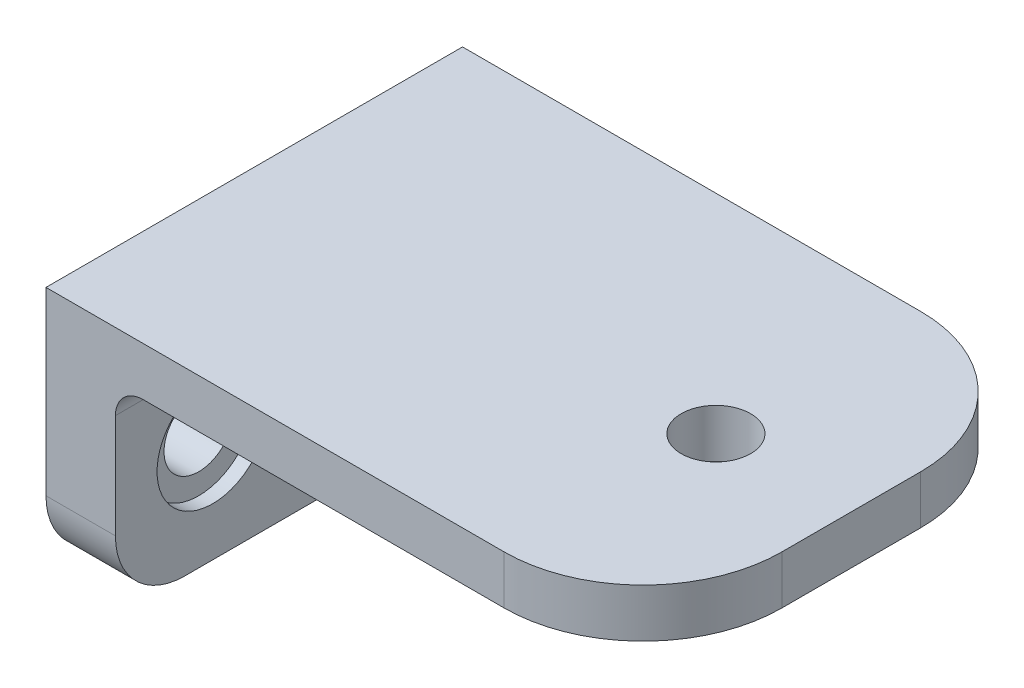
ISO-10303-21;
HEADER;
FILE_DESCRIPTION(('STEP AP214'),'2;1');
FILE_NAME('part.step','',(''),(''),'','','');
FILE_SCHEMA(('AUTOMOTIVE_DESIGN { 1 0 10303 214 1 1 1 1 }'));
ENDSEC;
DATA;
#1=APPLICATION_CONTEXT('core data for automotive mechanical design processes');
#2=APPLICATION_PROTOCOL_DEFINITION('international standard','automotive_design',2000,#1);
#3=PRODUCT_CONTEXT('',#1,'mechanical');
#4=PRODUCT('Part','Part','',(#3));
#5=PRODUCT_RELATED_PRODUCT_CATEGORY('part','',(#4));
#6=PRODUCT_DEFINITION_FORMATION('','',#4);
#7=PRODUCT_DEFINITION_CONTEXT('part definition',#1,'design');
#8=PRODUCT_DEFINITION('design','',#6,#7);
#9=PRODUCT_DEFINITION_SHAPE('','',#8);
#10=(LENGTH_UNIT() NAMED_UNIT(*) SI_UNIT(.MILLI.,.METRE.));
#11=(NAMED_UNIT(*) PLANE_ANGLE_UNIT() SI_UNIT($,.RADIAN.));
#12=(NAMED_UNIT(*) SI_UNIT($,.STERADIAN.) SOLID_ANGLE_UNIT());
#13=UNCERTAINTY_MEASURE_WITH_UNIT(LENGTH_MEASURE(1.E-05),#10,'distance_accuracy_value','');
#14=(GEOMETRIC_REPRESENTATION_CONTEXT(3) GLOBAL_UNCERTAINTY_ASSIGNED_CONTEXT((#13)) GLOBAL_UNIT_ASSIGNED_CONTEXT((#10,
#11,#12)) REPRESENTATION_CONTEXT('',''));
#15=CARTESIAN_POINT('',(0.,0.,0.));
#16=DIRECTION('',(0.,0.,1.));
#17=DIRECTION('',(1.,0.,0.));
#18=AXIS2_PLACEMENT_3D('',#15,#16,#17);
#19=CARTESIAN_POINT('',(19.,3.5,15.));
#20=DIRECTION('',(0.,0.,-1.));
#21=DIRECTION('',(-1.,0.,0.));
#22=AXIS2_PLACEMENT_3D('',#19,#20,#21);
#23=PLANE('',#22);
#24=DIRECTION('',(0.,1.,0.));
#25=VECTOR('',#24,1.);
#26=CARTESIAN_POINT('',(-24.,3.5,15.));
#27=LINE('',#26,#25);
#28=CARTESIAN_POINT('',(-24.,-9.5,15.));
#29=VERTEX_POINT('',#28);
#30=CARTESIAN_POINT('',(-24.,3.5,15.));
#31=VERTEX_POINT('',#30);
#32=EDGE_CURVE('E117',#29,#31,#27,.T.);
#33=ORIENTED_EDGE('',*,*,#32,.F.);
#34=DIRECTION('',(1.,0.,0.));
#35=VECTOR('',#34,1.);
#36=CARTESIAN_POINT('',(19.,-9.5,15.));
#37=LINE('',#36,#35);
#38=CARTESIAN_POINT('',(-19.,-9.5,15.));
#39=VERTEX_POINT('',#38);
#40=EDGE_CURVE('E11',#29,#39,#37,.T.);
#41=ORIENTED_EDGE('',*,*,#40,.T.);
#42=DIRECTION('',(0.,1.,0.));
#43=VECTOR('',#42,1.);
#44=CARTESIAN_POINT('',(-19.,3.5,15.));
#45=LINE('',#44,#43);
#46=CARTESIAN_POINT('',(-19.,-2.,15.));
#47=VERTEX_POINT('',#46);
#48=EDGE_CURVE('E151',#39,#47,#45,.T.);
#49=ORIENTED_EDGE('',*,*,#48,.T.);
#50=CARTESIAN_POINT('',(-17.,-2.,15.));
#51=DIRECTION('',(0.,0.,-1.));
#52=DIRECTION('',(-1.,0.,0.));
#53=AXIS2_PLACEMENT_3D('',#50,#51,#52);
#54=CIRCLE('',#53,2.);
#55=CARTESIAN_POINT('',(-17.,0.,15.));
#56=VERTEX_POINT('',#55);
#57=EDGE_CURVE('E196',#47,#56,#54,.T.);
#58=ORIENTED_EDGE('',*,*,#57,.T.);
#59=DIRECTION('',(1.,0.,0.));
#60=VECTOR('',#59,1.);
#61=CARTESIAN_POINT('',(19.,0.,15.));
#62=LINE('',#61,#60);
#63=CARTESIAN_POINT('',(9.,0.,15.));
#64=VERTEX_POINT('',#63);
#65=EDGE_CURVE('E139',#56,#64,#62,.T.);
#66=ORIENTED_EDGE('',*,*,#65,.T.);
#67=DIRECTION('',(0.,-1.,0.));
#68=VECTOR('',#67,1.);
#69=CARTESIAN_POINT('',(9.,3.5,15.));
#70=LINE('',#69,#68);
#71=CARTESIAN_POINT('',(9.,3.5,15.));
#72=VERTEX_POINT('',#71);
#73=EDGE_CURVE('E129',#64,#72,#70,.F.);
#74=ORIENTED_EDGE('',*,*,#73,.T.);
#75=DIRECTION('',(1.,0.,0.));
#76=VECTOR('',#75,1.);
#77=CARTESIAN_POINT('',(19.,3.5,15.));
#78=LINE('',#77,#76);
#79=EDGE_CURVE('E127',#31,#72,#78,.T.);
#80=ORIENTED_EDGE('',*,*,#79,.F.);
#81=EDGE_LOOP('',(#33,#41,#49,#58,#66,#74,#80));
#82=FACE_BOUND('',#81,.T.);
#83=ADVANCED_FACE('F33',(#82),#23,.F.);
#84=CARTESIAN_POINT('',(19.,3.5,15.));
#85=DIRECTION('',(-1.,0.,0.));
#86=DIRECTION('',(0.,0.,1.));
#87=AXIS2_PLACEMENT_3D('',#84,#85,#86);
#88=PLANE('',#87);
#89=DIRECTION('',(0.,0.,-1.));
#90=VECTOR('',#89,1.);
#91=CARTESIAN_POINT('',(19.,0.,15.));
#92=LINE('',#91,#90);
#93=CARTESIAN_POINT('',(19.,0.,5.));
#94=VERTEX_POINT('',#93);
#95=CARTESIAN_POINT('',(19.,0.,-5.));
#96=VERTEX_POINT('',#95);
#97=EDGE_CURVE('E141',#94,#96,#92,.T.);
#98=ORIENTED_EDGE('',*,*,#97,.T.);
#99=DIRECTION('',(0.,-1.,0.));
#100=VECTOR('',#99,1.);
#101=CARTESIAN_POINT('',(19.,3.5,-5.));
#102=LINE('',#101,#100);
#103=CARTESIAN_POINT('',(19.,3.5,-5.));
#104=VERTEX_POINT('',#103);
#105=EDGE_CURVE('E184',#96,#104,#102,.F.);
#106=ORIENTED_EDGE('',*,*,#105,.T.);
#107=DIRECTION('',(0.,0.,-1.));
#108=VECTOR('',#107,1.);
#109=CARTESIAN_POINT('',(19.,3.5,15.));
#110=LINE('',#109,#108);
#111=CARTESIAN_POINT('',(19.,3.5,5.));
#112=VERTEX_POINT('',#111);
#113=EDGE_CURVE('E132',#112,#104,#110,.T.);
#114=ORIENTED_EDGE('',*,*,#113,.F.);
#115=DIRECTION('',(0.,-1.,0.));
#116=VECTOR('',#115,1.);
#117=CARTESIAN_POINT('',(19.,3.5,5.));
#118=LINE('',#117,#116);
#119=EDGE_CURVE('E181',#112,#94,#118,.T.);
#120=ORIENTED_EDGE('',*,*,#119,.T.);
#121=EDGE_LOOP('',(#98,#106,#114,#120));
#122=FACE_BOUND('',#121,.T.);
#123=ADVANCED_FACE('F238',(#122),#88,.F.);
#124=CARTESIAN_POINT('',(19.,3.5,-15.));
#125=DIRECTION('',(0.,0.,1.));
#126=DIRECTION('',(1.,0.,0.));
#127=AXIS2_PLACEMENT_3D('',#124,#125,#126);
#128=PLANE('',#127);
#129=DIRECTION('',(0.,-1.,0.));
#130=VECTOR('',#129,1.);
#131=CARTESIAN_POINT('',(-19.,3.5,-15.));
#132=LINE('',#131,#130);
#133=CARTESIAN_POINT('',(-19.,-2.,-15.));
#134=VERTEX_POINT('',#133);
#135=CARTESIAN_POINT('',(-19.,-9.5,-15.));
#136=VERTEX_POINT('',#135);
#137=EDGE_CURVE('E145',#134,#136,#132,.T.);
#138=ORIENTED_EDGE('',*,*,#137,.T.);
#139=DIRECTION('',(1.,0.,0.));
#140=VECTOR('',#139,1.);
#141=CARTESIAN_POINT('',(19.,-9.5,-15.));
#142=LINE('',#141,#140);
#143=CARTESIAN_POINT('',(-24.,-9.5,-15.));
#144=VERTEX_POINT('',#143);
#145=EDGE_CURVE('E56',#136,#144,#142,.F.);
#146=ORIENTED_EDGE('',*,*,#145,.T.);
#147=DIRECTION('',(0.,-1.,0.));
#148=VECTOR('',#147,1.);
#149=CARTESIAN_POINT('',(-24.,3.5,-15.));
#150=LINE('',#149,#148);
#151=CARTESIAN_POINT('',(-24.,3.5,-15.));
#152=VERTEX_POINT('',#151);
#153=EDGE_CURVE('E152',#152,#144,#150,.T.);
#154=ORIENTED_EDGE('',*,*,#153,.F.);
#155=DIRECTION('',(-1.,0.,0.));
#156=VECTOR('',#155,1.);
#157=CARTESIAN_POINT('',(19.,3.5,-15.));
#158=LINE('',#157,#156);
#159=CARTESIAN_POINT('',(8.99999999999999,3.5,-15.));
#160=VERTEX_POINT('',#159);
#161=EDGE_CURVE('E138',#160,#152,#158,.T.);
#162=ORIENTED_EDGE('',*,*,#161,.F.);
#163=DIRECTION('',(0.,-1.,0.));
#164=VECTOR('',#163,1.);
#165=CARTESIAN_POINT('',(8.99999999999999,3.5,-15.));
#166=LINE('',#165,#164);
#167=CARTESIAN_POINT('',(8.99999999999999,0.,-15.));
#168=VERTEX_POINT('',#167);
#169=EDGE_CURVE('E155',#160,#168,#166,.T.);
#170=ORIENTED_EDGE('',*,*,#169,.T.);
#171=DIRECTION('',(-1.,0.,0.));
#172=VECTOR('',#171,1.);
#173=CARTESIAN_POINT('',(19.,0.,-15.));
#174=LINE('',#173,#172);
#175=CARTESIAN_POINT('',(-17.,0.,-15.));
#176=VERTEX_POINT('',#175);
#177=EDGE_CURVE('E133',#168,#176,#174,.T.);
#178=ORIENTED_EDGE('',*,*,#177,.T.);
#179=CARTESIAN_POINT('',(-17.,-2.,-15.));
#180=DIRECTION('',(0.,0.,1.));
#181=DIRECTION('',(1.,0.,0.));
#182=AXIS2_PLACEMENT_3D('',#179,#180,#181);
#183=CIRCLE('',#182,2.);
#184=EDGE_CURVE('E198',#176,#134,#183,.T.);
#185=ORIENTED_EDGE('',*,*,#184,.T.);
#186=EDGE_LOOP('',(#138,#146,#154,#162,#170,#178,#185));
#187=FACE_BOUND('',#186,.T.);
#188=ADVANCED_FACE('F223',(#187),#128,.F.);
#189=CARTESIAN_POINT('',(0.,3.5,0.));
#190=DIRECTION('',(0.,1.,0.));
#191=DIRECTION('',(0.,0.,1.));
#192=AXIS2_PLACEMENT_3D('',#189,#190,#191);
#193=PLANE('',#192);
#194=CARTESIAN_POINT('',(9.24999999999999,3.5,0.));
#195=DIRECTION('',(0.,1.,0.));
#196=DIRECTION('',(0.,0.,1.));
#197=AXIS2_PLACEMENT_3D('',#194,#195,#196);
#198=CIRCLE('',#197,2.5);
#199=CARTESIAN_POINT('',(9.24999999999999,3.5,2.5));
#200=VERTEX_POINT('',#199);
#201=EDGE_CURVE('E173',#200,#200,#198,.T.);
#202=ORIENTED_EDGE('',*,*,#201,.F.);
#203=EDGE_LOOP('',(#202));
#204=FACE_BOUND('',#203,.T.);
#205=ORIENTED_EDGE('',*,*,#113,.T.);
#206=CARTESIAN_POINT('',(9.,3.5,-5.));
#207=DIRECTION('',(0.,1.,0.));
#208=DIRECTION('',(0.,0.,1.));
#209=AXIS2_PLACEMENT_3D('',#206,#207,#208);
#210=CIRCLE('',#209,10.);
#211=EDGE_CURVE('E188',#104,#160,#210,.T.);
#212=ORIENTED_EDGE('',*,*,#211,.T.);
#213=ORIENTED_EDGE('',*,*,#161,.T.);
#214=DIRECTION('',(0.,0.,-1.));
#215=VECTOR('',#214,1.);
#216=CARTESIAN_POINT('',(-24.,3.5,-15.));
#217=LINE('',#216,#215);
#218=EDGE_CURVE('E121',#31,#152,#217,.T.);
#219=ORIENTED_EDGE('',*,*,#218,.F.);
#220=ORIENTED_EDGE('',*,*,#79,.T.);
#221=CARTESIAN_POINT('',(9.,3.5,5.));
#222=DIRECTION('',(0.,1.,0.));
#223=DIRECTION('',(0.,0.,1.));
#224=AXIS2_PLACEMENT_3D('',#221,#222,#223);
#225=CIRCLE('',#224,10.);
#226=EDGE_CURVE('E186',#72,#112,#225,.T.);
#227=ORIENTED_EDGE('',*,*,#226,.T.);
#228=EDGE_LOOP('',(#205,#212,#213,#219,#220,#227));
#229=FACE_BOUND('',#228,.T.);
#230=ADVANCED_FACE('F136',(#204,#229),#193,.T.);
#231=CARTESIAN_POINT('',(0.,0.,0.));
#232=DIRECTION('',(0.,1.,0.));
#233=DIRECTION('',(0.,0.,1.));
#234=AXIS2_PLACEMENT_3D('',#231,#232,#233);
#235=PLANE('',#234);
#236=CARTESIAN_POINT('',(9.24999999999999,0.,0.));
#237=DIRECTION('',(0.,1.,0.));
#238=DIRECTION('',(0.,0.,1.));
#239=AXIS2_PLACEMENT_3D('',#236,#237,#238);
#240=CIRCLE('',#239,2.5);
#241=CARTESIAN_POINT('',(9.24999999999999,0.,2.5));
#242=VERTEX_POINT('',#241);
#243=EDGE_CURVE('E169',#242,#242,#240,.T.);
#244=ORIENTED_EDGE('',*,*,#243,.T.);
#245=EDGE_LOOP('',(#244));
#246=FACE_BOUND('',#245,.T.);
#247=ORIENTED_EDGE('',*,*,#65,.F.);
#248=DIRECTION('',(0.,0.,1.));
#249=VECTOR('',#248,1.);
#250=CARTESIAN_POINT('',(-17.,0.,-15.));
#251=LINE('',#250,#249);
#252=EDGE_CURVE('E194',#56,#176,#251,.F.);
#253=ORIENTED_EDGE('',*,*,#252,.T.);
#254=ORIENTED_EDGE('',*,*,#177,.F.);
#255=CARTESIAN_POINT('',(9.,0.,-5.));
#256=DIRECTION('',(0.,1.,0.));
#257=DIRECTION('',(0.,0.,1.));
#258=AXIS2_PLACEMENT_3D('',#255,#256,#257);
#259=CIRCLE('',#258,10.);
#260=EDGE_CURVE('E179',#168,#96,#259,.F.);
#261=ORIENTED_EDGE('',*,*,#260,.T.);
#262=ORIENTED_EDGE('',*,*,#97,.F.);
#263=CARTESIAN_POINT('',(9.,0.,5.));
#264=DIRECTION('',(0.,1.,0.));
#265=DIRECTION('',(0.,0.,1.));
#266=AXIS2_PLACEMENT_3D('',#263,#264,#265);
#267=CIRCLE('',#266,10.);
#268=EDGE_CURVE('E176',#94,#64,#267,.F.);
#269=ORIENTED_EDGE('',*,*,#268,.T.);
#270=EDGE_LOOP('',(#247,#253,#254,#261,#262,#269));
#271=FACE_BOUND('',#270,.T.);
#272=ADVANCED_FACE('F299',(#246,#271),#235,.F.);
#273=CARTESIAN_POINT('',(-19.,0.,0.));
#274=DIRECTION('',(-1.,0.,0.));
#275=DIRECTION('',(0.,0.,1.));
#276=AXIS2_PLACEMENT_3D('',#273,#274,#275);
#277=PLANE('',#276);
#278=CARTESIAN_POINT('',(-19.,-7.,8.));
#279=DIRECTION('',(1.,0.,0.));
#280=DIRECTION('',(0.,0.,-1.));
#281=AXIS2_PLACEMENT_3D('',#278,#279,#280);
#282=CIRCLE('',#281,4.);
#283=CARTESIAN_POINT('',(-19.,-7.,4.));
#284=VERTEX_POINT('',#283);
#285=EDGE_CURVE('E432',#284,#284,#282,.T.);
#286=ORIENTED_EDGE('',*,*,#285,.F.);
#287=EDGE_LOOP('',(#286));
#288=FACE_BOUND('',#287,.T.);
#289=CARTESIAN_POINT('',(-19.,-6.99999999999999,-8.));
#290=DIRECTION('',(1.,0.,0.));
#291=DIRECTION('',(0.,0.,-1.));
#292=AXIS2_PLACEMENT_3D('',#289,#290,#291);
#293=CIRCLE('',#292,4.);
#294=CARTESIAN_POINT('',(-19.,-6.99999999999999,-12.));
#295=VERTEX_POINT('',#294);
#296=EDGE_CURVE('E168',#295,#295,#293,.T.);
#297=ORIENTED_EDGE('',*,*,#296,.F.);
#298=EDGE_LOOP('',(#297));
#299=FACE_BOUND('',#298,.T.);
#300=DIRECTION('',(0.,0.,1.));
#301=VECTOR('',#300,1.);
#302=CARTESIAN_POINT('',(-19.,-14.5,-15.));
#303=LINE('',#302,#301);
#304=CARTESIAN_POINT('',(-19.,-14.5,-10.));
#305=VERTEX_POINT('',#304);
#306=CARTESIAN_POINT('',(-19.,-14.5,10.));
#307=VERTEX_POINT('',#306);
#308=EDGE_CURVE('E147',#305,#307,#303,.T.);
#309=ORIENTED_EDGE('',*,*,#308,.F.);
#310=CARTESIAN_POINT('',(-19.,-9.5,-10.));
#311=DIRECTION('',(-1.,0.,0.));
#312=DIRECTION('',(0.,0.,1.));
#313=AXIS2_PLACEMENT_3D('',#310,#311,#312);
#314=CIRCLE('',#313,5.);
#315=EDGE_CURVE('E207',#305,#136,#314,.F.);
#316=ORIENTED_EDGE('',*,*,#315,.T.);
#317=ORIENTED_EDGE('',*,*,#137,.F.);
#318=DIRECTION('',(0.,0.,1.));
#319=VECTOR('',#318,1.);
#320=CARTESIAN_POINT('',(-19.,-2.,15.));
#321=LINE('',#320,#319);
#322=EDGE_CURVE('E191',#134,#47,#321,.T.);
#323=ORIENTED_EDGE('',*,*,#322,.T.);
#324=ORIENTED_EDGE('',*,*,#48,.F.);
#325=CARTESIAN_POINT('',(-19.,-9.5,10.));
#326=DIRECTION('',(-1.,0.,0.));
#327=DIRECTION('',(0.,0.,1.));
#328=AXIS2_PLACEMENT_3D('',#325,#326,#327);
#329=CIRCLE('',#328,5.);
#330=EDGE_CURVE('E205',#39,#307,#329,.F.);
#331=ORIENTED_EDGE('',*,*,#330,.T.);
#332=EDGE_LOOP('',(#309,#316,#317,#323,#324,#331));
#333=FACE_BOUND('',#332,.T.);
#334=ADVANCED_FACE('F221',(#288,#299,#333),#277,.F.);
#335=CARTESIAN_POINT('',(-24.,-14.5,-15.));
#336=DIRECTION('',(0.,1.,0.));
#337=DIRECTION('',(0.,0.,1.));
#338=AXIS2_PLACEMENT_3D('',#335,#336,#337);
#339=PLANE('',#338);
#340=DIRECTION('',(0.,0.,1.));
#341=VECTOR('',#340,1.);
#342=CARTESIAN_POINT('',(-24.,-14.5,-15.));
#343=LINE('',#342,#341);
#344=CARTESIAN_POINT('',(-24.,-14.5,-9.99999999999999));
#345=VERTEX_POINT('',#344);
#346=CARTESIAN_POINT('',(-24.,-14.5,10.));
#347=VERTEX_POINT('',#346);
#348=EDGE_CURVE('E124',#345,#347,#343,.T.);
#349=ORIENTED_EDGE('',*,*,#348,.F.);
#350=DIRECTION('',(1.,0.,0.));
#351=VECTOR('',#350,1.);
#352=CARTESIAN_POINT('',(-24.,-14.5,-9.99999999999999));
#353=LINE('',#352,#351);
#354=EDGE_CURVE('E202',#345,#305,#353,.T.);
#355=ORIENTED_EDGE('',*,*,#354,.T.);
#356=ORIENTED_EDGE('',*,*,#308,.T.);
#357=DIRECTION('',(1.,0.,0.));
#358=VECTOR('',#357,1.);
#359=CARTESIAN_POINT('',(-24.,-14.5,10.));
#360=LINE('',#359,#358);
#361=EDGE_CURVE('E200',#307,#347,#360,.F.);
#362=ORIENTED_EDGE('',*,*,#361,.T.);
#363=EDGE_LOOP('',(#349,#355,#356,#362));
#364=FACE_BOUND('',#363,.T.);
#365=ADVANCED_FACE('F215',(#364),#339,.F.);
#366=CARTESIAN_POINT('',(-24.,0.,0.));
#367=DIRECTION('',(-1.,0.,0.));
#368=DIRECTION('',(0.,0.,1.));
#369=AXIS2_PLACEMENT_3D('',#366,#367,#368);
#370=PLANE('',#369);
#371=CARTESIAN_POINT('',(-24.,-7.,8.));
#372=DIRECTION('',(-1.,0.,0.));
#373=DIRECTION('',(0.,0.,1.));
#374=AXIS2_PLACEMENT_3D('',#371,#372,#373);
#375=CIRCLE('',#374,2.5);
#376=CARTESIAN_POINT('',(-24.,-7.,10.5));
#377=VERTEX_POINT('',#376);
#378=EDGE_CURVE('E164',#377,#377,#375,.T.);
#379=ORIENTED_EDGE('',*,*,#378,.F.);
#380=EDGE_LOOP('',(#379));
#381=FACE_BOUND('',#380,.T.);
#382=CARTESIAN_POINT('',(-24.,-6.99999999999999,-8.));
#383=DIRECTION('',(-1.,0.,0.));
#384=DIRECTION('',(0.,0.,1.));
#385=AXIS2_PLACEMENT_3D('',#382,#383,#384);
#386=CIRCLE('',#385,2.5);
#387=CARTESIAN_POINT('',(-24.,-6.99999999999999,-5.5));
#388=VERTEX_POINT('',#387);
#389=EDGE_CURVE('E161',#388,#388,#386,.T.);
#390=ORIENTED_EDGE('',*,*,#389,.F.);
#391=EDGE_LOOP('',(#390));
#392=FACE_BOUND('',#391,.T.);
#393=ORIENTED_EDGE('',*,*,#153,.T.);
#394=CARTESIAN_POINT('',(-24.,-9.5,-9.99999999999999));
#395=DIRECTION('',(-1.,0.,0.));
#396=DIRECTION('',(0.,0.,1.));
#397=AXIS2_PLACEMENT_3D('',#394,#395,#396);
#398=CIRCLE('',#397,5.);
#399=EDGE_CURVE('E41',#144,#345,#398,.T.);
#400=ORIENTED_EDGE('',*,*,#399,.T.);
#401=ORIENTED_EDGE('',*,*,#348,.T.);
#402=CARTESIAN_POINT('',(-24.,-9.5,10.));
#403=DIRECTION('',(-1.,0.,0.));
#404=DIRECTION('',(0.,0.,1.));
#405=AXIS2_PLACEMENT_3D('',#402,#403,#404);
#406=CIRCLE('',#405,5.);
#407=EDGE_CURVE('E48',#347,#29,#406,.T.);
#408=ORIENTED_EDGE('',*,*,#407,.T.);
#409=ORIENTED_EDGE('',*,*,#32,.T.);
#410=ORIENTED_EDGE('',*,*,#218,.T.);
#411=EDGE_LOOP('',(#393,#400,#401,#408,#409,#410));
#412=FACE_BOUND('',#411,.T.);
#413=ADVANCED_FACE('F119',(#381,#392,#412),#370,.T.);
#414=CARTESIAN_POINT('',(-20.,-6.99999999999999,-8.));
#415=DIRECTION('',(1.,0.,0.));
#416=DIRECTION('',(0.,0.,-1.));
#417=AXIS2_PLACEMENT_3D('',#414,#415,#416);
#418=CYLINDRICAL_SURFACE('',#417,4.);
#419=CARTESIAN_POINT('',(-20.,-6.99999999999999,-8.));
#420=DIRECTION('',(1.,0.,0.));
#421=DIRECTION('',(0.,0.,-1.));
#422=AXIS2_PLACEMENT_3D('',#419,#420,#421);
#423=CIRCLE('',#422,4.);
#424=CARTESIAN_POINT('',(-20.,-6.99999999999999,-12.));
#425=VERTEX_POINT('',#424);
#426=EDGE_CURVE('E427',#425,#425,#423,.T.);
#427=ORIENTED_EDGE('',*,*,#426,.F.);
#428=EDGE_LOOP('',(#427));
#429=FACE_BOUND('',#428,.T.);
#430=ORIENTED_EDGE('',*,*,#296,.T.);
#431=EDGE_LOOP('',(#430));
#432=FACE_BOUND('',#431,.T.);
#433=ADVANCED_FACE('F279',(#429,#432),#418,.F.);
#434=CARTESIAN_POINT('',(-20.,-6.99999999999999,-8.));
#435=DIRECTION('',(1.,0.,0.));
#436=DIRECTION('',(0.,0.,-1.));
#437=AXIS2_PLACEMENT_3D('',#434,#435,#436);
#438=PLANE('',#437);
#439=CARTESIAN_POINT('',(-20.,-6.99999999999999,-8.));
#440=DIRECTION('',(1.,0.,0.));
#441=DIRECTION('',(0.,0.,-1.));
#442=AXIS2_PLACEMENT_3D('',#439,#440,#441);
#443=CIRCLE('',#442,2.5);
#444=CARTESIAN_POINT('',(-20.,-6.99999999999999,-10.5));
#445=VERTEX_POINT('',#444);
#446=EDGE_CURVE('E172',#445,#445,#443,.T.);
#447=ORIENTED_EDGE('',*,*,#446,.F.);
#448=EDGE_LOOP('',(#447));
#449=FACE_BOUND('',#448,.T.);
#450=ORIENTED_EDGE('',*,*,#426,.T.);
#451=EDGE_LOOP('',(#450));
#452=FACE_BOUND('',#451,.T.);
#453=ADVANCED_FACE('F395',(#449,#452),#438,.T.);
#454=CARTESIAN_POINT('',(-20.,-7.,8.));
#455=DIRECTION('',(1.,0.,0.));
#456=DIRECTION('',(0.,0.,-1.));
#457=AXIS2_PLACEMENT_3D('',#454,#455,#456);
#458=CYLINDRICAL_SURFACE('',#457,4.);
#459=CARTESIAN_POINT('',(-20.,-7.,8.));
#460=DIRECTION('',(1.,0.,0.));
#461=DIRECTION('',(0.,0.,-1.));
#462=AXIS2_PLACEMENT_3D('',#459,#460,#461);
#463=CIRCLE('',#462,4.);
#464=CARTESIAN_POINT('',(-20.,-7.,4.));
#465=VERTEX_POINT('',#464);
#466=EDGE_CURVE('E148',#465,#465,#463,.T.);
#467=ORIENTED_EDGE('',*,*,#466,.F.);
#468=EDGE_LOOP('',(#467));
#469=FACE_BOUND('',#468,.T.);
#470=ORIENTED_EDGE('',*,*,#285,.T.);
#471=EDGE_LOOP('',(#470));
#472=FACE_BOUND('',#471,.T.);
#473=ADVANCED_FACE('F386',(#469,#472),#458,.F.);
#474=CARTESIAN_POINT('',(-20.,-7.,8.));
#475=DIRECTION('',(1.,0.,0.));
#476=DIRECTION('',(0.,0.,-1.));
#477=AXIS2_PLACEMENT_3D('',#474,#475,#476);
#478=PLANE('',#477);
#479=CARTESIAN_POINT('',(-20.,-7.,8.));
#480=DIRECTION('',(1.,0.,0.));
#481=DIRECTION('',(0.,0.,-1.));
#482=AXIS2_PLACEMENT_3D('',#479,#480,#481);
#483=CIRCLE('',#482,2.5);
#484=CARTESIAN_POINT('',(-20.,-7.,5.5));
#485=VERTEX_POINT('',#484);
#486=EDGE_CURVE('E165',#485,#485,#483,.T.);
#487=ORIENTED_EDGE('',*,*,#486,.F.);
#488=EDGE_LOOP('',(#487));
#489=FACE_BOUND('',#488,.T.);
#490=ORIENTED_EDGE('',*,*,#466,.T.);
#491=EDGE_LOOP('',(#490));
#492=FACE_BOUND('',#491,.T.);
#493=ADVANCED_FACE('F378',(#489,#492),#478,.T.);
#494=CARTESIAN_POINT('',(-25.,-6.99999999999999,-8.));
#495=DIRECTION('',(1.,0.,0.));
#496=DIRECTION('',(0.,0.,-1.));
#497=AXIS2_PLACEMENT_3D('',#494,#495,#496);
#498=CYLINDRICAL_SURFACE('',#497,2.5);
#499=ORIENTED_EDGE('',*,*,#389,.T.);
#500=EDGE_LOOP('',(#499));
#501=FACE_BOUND('',#500,.T.);
#502=ORIENTED_EDGE('',*,*,#446,.T.);
#503=EDGE_LOOP('',(#502));
#504=FACE_BOUND('',#503,.T.);
#505=ADVANCED_FACE('F370',(#501,#504),#498,.F.);
#506=CARTESIAN_POINT('',(-25.,-7.,8.));
#507=DIRECTION('',(1.,0.,0.));
#508=DIRECTION('',(0.,0.,-1.));
#509=AXIS2_PLACEMENT_3D('',#506,#507,#508);
#510=CYLINDRICAL_SURFACE('',#509,2.5);
#511=ORIENTED_EDGE('',*,*,#378,.T.);
#512=EDGE_LOOP('',(#511));
#513=FACE_BOUND('',#512,.T.);
#514=ORIENTED_EDGE('',*,*,#486,.T.);
#515=EDGE_LOOP('',(#514));
#516=FACE_BOUND('',#515,.T.);
#517=ADVANCED_FACE('F365',(#513,#516),#510,.F.);
#518=CARTESIAN_POINT('',(9.24999999999999,-1.5,0.));
#519=DIRECTION('',(0.,1.,0.));
#520=DIRECTION('',(0.,0.,1.));
#521=AXIS2_PLACEMENT_3D('',#518,#519,#520);
#522=CYLINDRICAL_SURFACE('',#521,2.5);
#523=ORIENTED_EDGE('',*,*,#201,.T.);
#524=EDGE_LOOP('',(#523));
#525=FACE_BOUND('',#524,.T.);
#526=ORIENTED_EDGE('',*,*,#243,.F.);
#527=EDGE_LOOP('',(#526));
#528=FACE_BOUND('',#527,.T.);
#529=ADVANCED_FACE('F251',(#525,#528),#522,.F.);
#530=CARTESIAN_POINT('',(9.,3.5,-5.));
#531=DIRECTION('',(0.,-1.,0.));
#532=DIRECTION('',(0.,0.,-1.));
#533=AXIS2_PLACEMENT_3D('',#530,#531,#532);
#534=CYLINDRICAL_SURFACE('',#533,10.);
#535=ORIENTED_EDGE('',*,*,#211,.F.);
#536=ORIENTED_EDGE('',*,*,#105,.F.);
#537=ORIENTED_EDGE('',*,*,#260,.F.);
#538=ORIENTED_EDGE('',*,*,#169,.F.);
#539=EDGE_LOOP('',(#535,#536,#537,#538));
#540=FACE_BOUND('',#539,.T.);
#541=ADVANCED_FACE('F247',(#540),#534,.T.);
#542=CARTESIAN_POINT('',(9.,3.5,5.));
#543=DIRECTION('',(0.,-1.,0.));
#544=DIRECTION('',(0.,0.,-1.));
#545=AXIS2_PLACEMENT_3D('',#542,#543,#544);
#546=CYLINDRICAL_SURFACE('',#545,10.);
#547=ORIENTED_EDGE('',*,*,#226,.F.);
#548=ORIENTED_EDGE('',*,*,#73,.F.);
#549=ORIENTED_EDGE('',*,*,#268,.F.);
#550=ORIENTED_EDGE('',*,*,#119,.F.);
#551=EDGE_LOOP('',(#547,#548,#549,#550));
#552=FACE_BOUND('',#551,.T.);
#553=ADVANCED_FACE('F250',(#552),#546,.T.);
#554=CARTESIAN_POINT('',(-17.,-2.,0.));
#555=DIRECTION('',(0.,0.,-1.));
#556=DIRECTION('',(-1.,0.,0.));
#557=AXIS2_PLACEMENT_3D('',#554,#555,#556);
#558=CYLINDRICAL_SURFACE('',#557,2.);
#559=ORIENTED_EDGE('',*,*,#184,.F.);
#560=ORIENTED_EDGE('',*,*,#252,.F.);
#561=ORIENTED_EDGE('',*,*,#57,.F.);
#562=ORIENTED_EDGE('',*,*,#322,.F.);
#563=EDGE_LOOP('',(#559,#560,#561,#562));
#564=FACE_BOUND('',#563,.T.);
#565=ADVANCED_FACE('F228',(#564),#558,.F.);
#566=CARTESIAN_POINT('',(-24.,-9.5,-9.99999999999999));
#567=DIRECTION('',(1.,0.,0.));
#568=DIRECTION('',(0.,0.,-1.));
#569=AXIS2_PLACEMENT_3D('',#566,#567,#568);
#570=CYLINDRICAL_SURFACE('',#569,5.);
#571=ORIENTED_EDGE('',*,*,#399,.F.);
#572=ORIENTED_EDGE('',*,*,#145,.F.);
#573=ORIENTED_EDGE('',*,*,#315,.F.);
#574=ORIENTED_EDGE('',*,*,#354,.F.);
#575=EDGE_LOOP('',(#571,#572,#573,#574));
#576=FACE_BOUND('',#575,.T.);
#577=ADVANCED_FACE('F218',(#576),#570,.T.);
#578=CARTESIAN_POINT('',(19.,-9.5,10.));
#579=DIRECTION('',(1.,0.,0.));
#580=DIRECTION('',(0.,0.,-1.));
#581=AXIS2_PLACEMENT_3D('',#578,#579,#580);
#582=CYLINDRICAL_SURFACE('',#581,5.);
#583=ORIENTED_EDGE('',*,*,#407,.F.);
#584=ORIENTED_EDGE('',*,*,#361,.F.);
#585=ORIENTED_EDGE('',*,*,#330,.F.);
#586=ORIENTED_EDGE('',*,*,#40,.F.);
#587=EDGE_LOOP('',(#583,#584,#585,#586));
#588=FACE_BOUND('',#587,.T.);
#589=ADVANCED_FACE('F35',(#588),#582,.T.);
#590=CLOSED_SHELL('',(#83,#123,#188,#230,#272,#334,#365,#413,#433,#453,#473,#493,#505,#517,#529,
#541,#553,#565,#577,#589));
#591=MANIFOLD_SOLID_BREP('B2',#590);
#592=ADVANCED_BREP_SHAPE_REPRESENTATION('',(#18,#591),#14);
#593=SHAPE_DEFINITION_REPRESENTATION(#9,#592);
ENDSEC;
END-ISO-10303-21;
